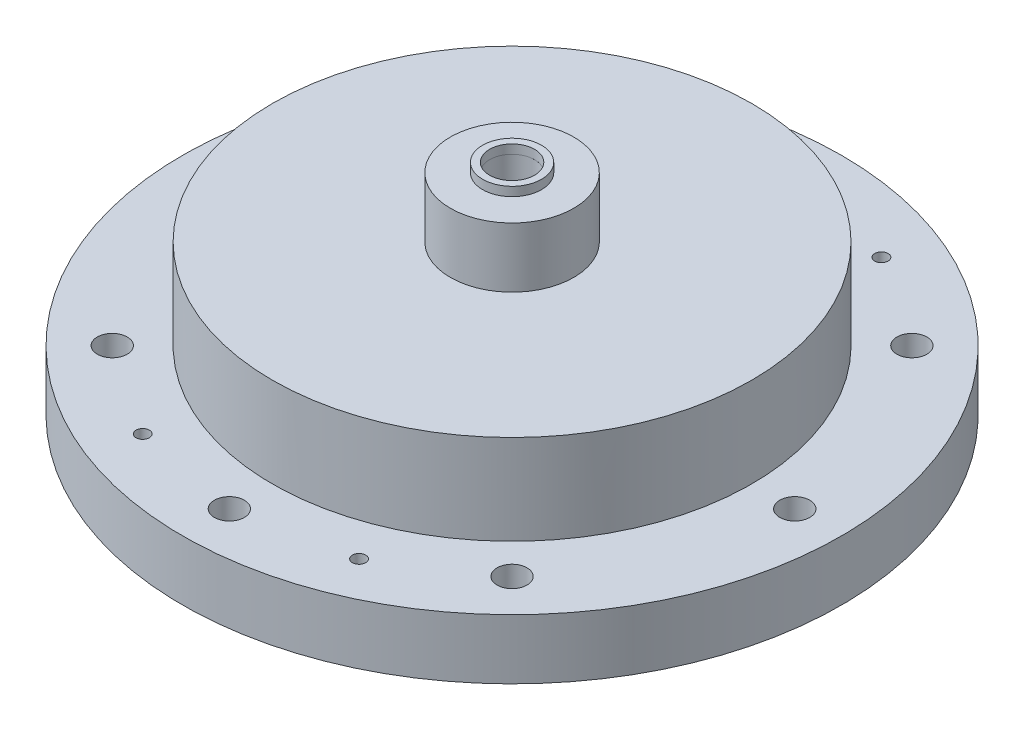
ISO-10303-21;
HEADER;
FILE_DESCRIPTION(('STEP AP214'),'2;1');
FILE_NAME('part.step','',(''),(''),'','','');
FILE_SCHEMA(('AUTOMOTIVE_DESIGN { 1 0 10303 214 1 1 1 1 }'));
ENDSEC;
DATA;
#1=APPLICATION_CONTEXT('core data for automotive mechanical design processes');
#2=APPLICATION_PROTOCOL_DEFINITION('international standard','automotive_design',2000,#1);
#3=PRODUCT_CONTEXT('',#1,'mechanical');
#4=PRODUCT('Part','Part','',(#3));
#5=PRODUCT_RELATED_PRODUCT_CATEGORY('part','',(#4));
#6=PRODUCT_DEFINITION_FORMATION('','',#4);
#7=PRODUCT_DEFINITION_CONTEXT('part definition',#1,'design');
#8=PRODUCT_DEFINITION('design','',#6,#7);
#9=PRODUCT_DEFINITION_SHAPE('','',#8);
#10=(LENGTH_UNIT() NAMED_UNIT(*) SI_UNIT(.MILLI.,.METRE.));
#11=(NAMED_UNIT(*) PLANE_ANGLE_UNIT() SI_UNIT($,.RADIAN.));
#12=(NAMED_UNIT(*) SI_UNIT($,.STERADIAN.) SOLID_ANGLE_UNIT());
#13=UNCERTAINTY_MEASURE_WITH_UNIT(LENGTH_MEASURE(1.E-05),#10,'distance_accuracy_value','');
#14=(GEOMETRIC_REPRESENTATION_CONTEXT(3) GLOBAL_UNCERTAINTY_ASSIGNED_CONTEXT((#13)) GLOBAL_UNIT_ASSIGNED_CONTEXT((#10,
#11,#12)) REPRESENTATION_CONTEXT('',''));
#15=CARTESIAN_POINT('',(0.,0.,0.));
#16=DIRECTION('',(0.,0.,1.));
#17=DIRECTION('',(1.,0.,0.));
#18=AXIS2_PLACEMENT_3D('',#15,#16,#17);
#19=CARTESIAN_POINT('',(0.,46.355,0.));
#20=DIRECTION('',(0.,-1.,0.));
#21=DIRECTION('',(0.,0.,-1.));
#22=AXIS2_PLACEMENT_3D('',#19,#20,#21);
#23=CYLINDRICAL_SURFACE('',#22,6.2484);
#24=CARTESIAN_POINT('',(0.,46.355,0.));
#25=DIRECTION('',(0.,1.,0.));
#26=DIRECTION('',(0.,0.,1.));
#27=AXIS2_PLACEMENT_3D('',#24,#25,#26);
#28=CIRCLE('',#27,6.2484);
#29=CARTESIAN_POINT('',(0.,46.355,6.2484));
#30=VERTEX_POINT('',#29);
#31=EDGE_CURVE('E11',#30,#30,#28,.T.);
#32=ORIENTED_EDGE('',*,*,#31,.F.);
#33=EDGE_LOOP('',(#32));
#34=FACE_BOUND('',#33,.T.);
#35=CARTESIAN_POINT('',(0.,44.45,0.));
#36=DIRECTION('',(0.,1.,0.));
#37=DIRECTION('',(0.,0.,1.));
#38=AXIS2_PLACEMENT_3D('',#35,#36,#37);
#39=CIRCLE('',#38,6.2484);
#40=CARTESIAN_POINT('',(0.,44.45,6.2484));
#41=VERTEX_POINT('',#40);
#42=EDGE_CURVE('E49',#41,#41,#39,.T.);
#43=ORIENTED_EDGE('',*,*,#42,.T.);
#44=EDGE_LOOP('',(#43));
#45=FACE_BOUND('',#44,.T.);
#46=ADVANCED_FACE('F42',(#34,#45),#23,.T.);
#47=CARTESIAN_POINT('',(0.,46.355,0.));
#48=DIRECTION('',(0.,1.,0.));
#49=DIRECTION('',(0.,0.,1.));
#50=AXIS2_PLACEMENT_3D('',#47,#48,#49);
#51=PLANE('',#50);
#52=CARTESIAN_POINT('',(0.,46.355,0.));
#53=DIRECTION('',(0.,1.,0.));
#54=DIRECTION('',(0.,0.,1.));
#55=AXIS2_PLACEMENT_3D('',#52,#53,#54);
#56=CIRCLE('',#55,4.7625);
#57=CARTESIAN_POINT('',(0.,46.355,4.7625));
#58=VERTEX_POINT('',#57);
#59=EDGE_CURVE('E55',#58,#58,#56,.T.);
#60=ORIENTED_EDGE('',*,*,#59,.F.);
#61=EDGE_LOOP('',(#60));
#62=FACE_BOUND('',#61,.T.);
#63=ORIENTED_EDGE('',*,*,#31,.T.);
#64=EDGE_LOOP('',(#63));
#65=FACE_BOUND('',#64,.T.);
#66=ADVANCED_FACE('F71',(#62,#65),#51,.T.);
#67=CARTESIAN_POINT('',(0.,44.45,0.));
#68=DIRECTION('',(0.,1.,0.));
#69=DIRECTION('',(0.,0.,1.));
#70=AXIS2_PLACEMENT_3D('',#67,#68,#69);
#71=PLANE('',#70);
#72=CARTESIAN_POINT('',(0.,44.45,0.));
#73=DIRECTION('',(0.,1.,0.));
#74=DIRECTION('',(0.,0.,1.));
#75=AXIS2_PLACEMENT_3D('',#72,#73,#74);
#76=CIRCLE('',#75,4.7625);
#77=CARTESIAN_POINT('',(0.,44.45,4.7625));
#78=VERTEX_POINT('',#77);
#79=EDGE_CURVE('E45',#78,#78,#76,.T.);
#80=ORIENTED_EDGE('',*,*,#79,.T.);
#81=EDGE_LOOP('',(#80));
#82=FACE_BOUND('',#81,.T.);
#83=ORIENTED_EDGE('',*,*,#42,.F.);
#84=EDGE_LOOP('',(#83));
#85=FACE_BOUND('',#84,.T.);
#86=ADVANCED_FACE('F62',(#82,#85),#71,.F.);
#87=CARTESIAN_POINT('',(0.,-4.445,0.));
#88=DIRECTION('',(0.,1.,0.));
#89=DIRECTION('',(0.,0.,1.));
#90=AXIS2_PLACEMENT_3D('',#87,#88,#89);
#91=CYLINDRICAL_SURFACE('',#90,4.7625);
#92=ORIENTED_EDGE('',*,*,#59,.T.);
#93=EDGE_LOOP('',(#92));
#94=FACE_BOUND('',#93,.T.);
#95=ORIENTED_EDGE('',*,*,#79,.F.);
#96=EDGE_LOOP('',(#95));
#97=FACE_BOUND('',#96,.T.);
#98=ADVANCED_FACE('F65',(#94,#97),#91,.F.);
#99=CLOSED_SHELL('',(#46,#66,#86,#98));
#100=MANIFOLD_SOLID_BREP('B2',#99);
#101=CARTESIAN_POINT('',(0.,44.45,0.));
#102=DIRECTION('',(0.,-1.,0.));
#103=DIRECTION('',(0.,0.,-1.));
#104=AXIS2_PLACEMENT_3D('',#101,#102,#103);
#105=CYLINDRICAL_SURFACE('',#104,4.7625);
#106=CARTESIAN_POINT('',(0.,44.45,0.));
#107=DIRECTION('',(0.,1.,0.));
#108=DIRECTION('',(0.,0.,1.));
#109=AXIS2_PLACEMENT_3D('',#106,#107,#108);
#110=CIRCLE('',#109,4.7625);
#111=CARTESIAN_POINT('',(0.,44.45,4.7625));
#112=VERTEX_POINT('',#111);
#113=EDGE_CURVE('E168',#112,#112,#110,.T.);
#114=ORIENTED_EDGE('',*,*,#113,.T.);
#115=EDGE_LOOP('',(#114));
#116=FACE_BOUND('',#115,.T.);
#117=CARTESIAN_POINT('',(0.,25.4,0.));
#118=DIRECTION('',(0.,-1.,0.));
#119=DIRECTION('',(0.,0.,-1.));
#120=AXIS2_PLACEMENT_3D('',#117,#118,#119);
#121=CIRCLE('',#120,4.7625);
#122=CARTESIAN_POINT('',(0.,25.4,-4.7625));
#123=VERTEX_POINT('',#122);
#124=EDGE_CURVE('E108',#123,#123,#121,.T.);
#125=ORIENTED_EDGE('',*,*,#124,.T.);
#126=EDGE_LOOP('',(#125));
#127=FACE_BOUND('',#126,.T.);
#128=ADVANCED_FACE('F104',(#116,#127),#105,.F.);
#129=CARTESIAN_POINT('',(0.,25.4,0.));
#130=DIRECTION('',(0.,-1.,0.));
#131=DIRECTION('',(0.,0.,-1.));
#132=AXIS2_PLACEMENT_3D('',#129,#130,#131);
#133=CYLINDRICAL_SURFACE('',#132,50.8);
#134=CARTESIAN_POINT('',(0.,12.7,0.));
#135=DIRECTION('',(0.,-1.,0.));
#136=DIRECTION('',(0.,0.,-1.));
#137=AXIS2_PLACEMENT_3D('',#134,#135,#136);
#138=CIRCLE('',#137,50.8);
#139=CARTESIAN_POINT('',(0.,12.7,-50.8));
#140=VERTEX_POINT('',#139);
#141=EDGE_CURVE('E41',#140,#140,#138,.T.);
#142=ORIENTED_EDGE('',*,*,#141,.F.);
#143=EDGE_LOOP('',(#142));
#144=FACE_BOUND('',#143,.T.);
#145=CARTESIAN_POINT('',(0.,31.75,0.));
#146=DIRECTION('',(0.,1.,0.));
#147=DIRECTION('',(0.,0.,1.));
#148=AXIS2_PLACEMENT_3D('',#145,#146,#147);
#149=CIRCLE('',#148,50.8);
#150=CARTESIAN_POINT('',(0.,31.75,50.8));
#151=VERTEX_POINT('',#150);
#152=EDGE_CURVE('E160',#151,#151,#149,.T.);
#153=ORIENTED_EDGE('',*,*,#152,.F.);
#154=EDGE_LOOP('',(#153));
#155=FACE_BOUND('',#154,.T.);
#156=ADVANCED_FACE('F106',(#144,#155),#133,.T.);
#157=CARTESIAN_POINT('',(0.,12.7,0.));
#158=DIRECTION('',(0.,-1.,0.));
#159=DIRECTION('',(0.,0.,-1.));
#160=AXIS2_PLACEMENT_3D('',#157,#158,#159);
#161=CYLINDRICAL_SURFACE('',#160,69.85);
#162=CARTESIAN_POINT('',(0.,12.7,0.));
#163=DIRECTION('',(0.,-1.,0.));
#164=DIRECTION('',(0.,0.,-1.));
#165=AXIS2_PLACEMENT_3D('',#162,#163,#164);
#166=CIRCLE('',#165,69.85);
#167=CARTESIAN_POINT('',(0.,12.7,-69.85));
#168=VERTEX_POINT('',#167);
#169=EDGE_CURVE('E112',#168,#168,#166,.T.);
#170=ORIENTED_EDGE('',*,*,#169,.T.);
#171=EDGE_LOOP('',(#170));
#172=FACE_BOUND('',#171,.T.);
#173=CARTESIAN_POINT('',(0.,0.,0.));
#174=DIRECTION('',(0.,-1.,0.));
#175=DIRECTION('',(0.,0.,-1.));
#176=AXIS2_PLACEMENT_3D('',#173,#174,#175);
#177=CIRCLE('',#176,69.85);
#178=CARTESIAN_POINT('',(0.,0.,-69.85));
#179=VERTEX_POINT('',#178);
#180=EDGE_CURVE('E117',#179,#179,#177,.T.);
#181=ORIENTED_EDGE('',*,*,#180,.F.);
#182=EDGE_LOOP('',(#181));
#183=FACE_BOUND('',#182,.T.);
#184=ADVANCED_FACE('F228',(#172,#183),#161,.T.);
#185=CARTESIAN_POINT('',(0.,12.7,0.));
#186=DIRECTION('',(0.,-1.,0.));
#187=DIRECTION('',(0.,0.,-1.));
#188=AXIS2_PLACEMENT_3D('',#185,#186,#187);
#189=PLANE('',#188);
#190=CARTESIAN_POINT('',(22.9298555105109,12.7,55.3575681567308));
#191=DIRECTION('',(0.,-1.,0.));
#192=DIRECTION('',(0.,0.,-1.));
#193=AXIS2_PLACEMENT_3D('',#190,#191,#192);
#194=CIRCLE('',#193,1.4097);
#195=CARTESIAN_POINT('',(22.9298555105109,12.7,53.9478681567308));
#196=VERTEX_POINT('',#195);
#197=EDGE_CURVE('E130',#196,#196,#194,.T.);
#198=ORIENTED_EDGE('',*,*,#197,.T.);
#199=EDGE_LOOP('',(#198));
#200=FACE_BOUND('',#199,.T.);
#201=CARTESIAN_POINT('',(-22.9298555105109,12.7,-55.3575681567308));
#202=DIRECTION('',(0.,-1.,0.));
#203=DIRECTION('',(0.,0.,-1.));
#204=AXIS2_PLACEMENT_3D('',#201,#202,#203);
#205=CIRCLE('',#204,1.4097);
#206=CARTESIAN_POINT('',(-22.9298555105109,12.7,-56.7672681567308));
#207=VERTEX_POINT('',#206);
#208=EDGE_CURVE('E128',#207,#207,#205,.T.);
#209=ORIENTED_EDGE('',*,*,#208,.T.);
#210=EDGE_LOOP('',(#209));
#211=FACE_BOUND('',#210,.T.);
#212=CARTESIAN_POINT('',(22.9298555105109,12.7,-55.3575681567308));
#213=DIRECTION('',(0.,-1.,0.));
#214=DIRECTION('',(0.,0.,-1.));
#215=AXIS2_PLACEMENT_3D('',#212,#213,#214);
#216=CIRCLE('',#215,1.4097);
#217=CARTESIAN_POINT('',(22.9298555105109,12.7,-56.7672681567308));
#218=VERTEX_POINT('',#217);
#219=EDGE_CURVE('E124',#218,#218,#216,.T.);
#220=ORIENTED_EDGE('',*,*,#219,.T.);
#221=EDGE_LOOP('',(#220));
#222=FACE_BOUND('',#221,.T.);
#223=CARTESIAN_POINT('',(-22.9298555105109,12.7,55.3575681567308));
#224=DIRECTION('',(0.,-1.,0.));
#225=DIRECTION('',(0.,0.,-1.));
#226=AXIS2_PLACEMENT_3D('',#223,#224,#225);
#227=CIRCLE('',#226,1.4097);
#228=CARTESIAN_POINT('',(-22.9298555105109,12.7,53.9478681567308));
#229=VERTEX_POINT('',#228);
#230=EDGE_CURVE('E121',#229,#229,#227,.T.);
#231=ORIENTED_EDGE('',*,*,#230,.T.);
#232=EDGE_LOOP('',(#231));
#233=FACE_BOUND('',#232,.T.);
#234=CARTESIAN_POINT('',(0.,12.7,-59.9186));
#235=DIRECTION('',(0.,-1.,0.));
#236=DIRECTION('',(0.,0.,-1.));
#237=AXIS2_PLACEMENT_3D('',#234,#235,#236);
#238=CIRCLE('',#237,3.175);
#239=CARTESIAN_POINT('',(0.,12.7,-63.0936));
#240=VERTEX_POINT('',#239);
#241=EDGE_CURVE('E178',#240,#240,#238,.F.);
#242=ORIENTED_EDGE('',*,*,#241,.F.);
#243=EDGE_LOOP('',(#242));
#244=FACE_BOUND('',#243,.T.);
#245=CARTESIAN_POINT('',(-42.3688483792043,12.7,-42.3688483792043));
#246=DIRECTION('',(0.,-1.,0.));
#247=DIRECTION('',(0.,0.,-1.));
#248=AXIS2_PLACEMENT_3D('',#245,#246,#247);
#249=CIRCLE('',#248,3.17500000000001);
#250=CARTESIAN_POINT('',(-42.3688483792043,12.7,-45.5438483792043));
#251=VERTEX_POINT('',#250);
#252=EDGE_CURVE('E179',#251,#251,#249,.F.);
#253=ORIENTED_EDGE('',*,*,#252,.F.);
#254=EDGE_LOOP('',(#253));
#255=FACE_BOUND('',#254,.T.);
#256=CARTESIAN_POINT('',(-59.9186,12.7,0.));
#257=DIRECTION('',(0.,-1.,0.));
#258=DIRECTION('',(0.,0.,-1.));
#259=AXIS2_PLACEMENT_3D('',#256,#257,#258);
#260=CIRCLE('',#259,3.17499999999999);
#261=CARTESIAN_POINT('',(-59.9186,12.7,-3.17499999999999));
#262=VERTEX_POINT('',#261);
#263=EDGE_CURVE('E185',#262,#262,#260,.F.);
#264=ORIENTED_EDGE('',*,*,#263,.F.);
#265=EDGE_LOOP('',(#264));
#266=FACE_BOUND('',#265,.T.);
#267=CARTESIAN_POINT('',(-42.3688483792043,12.7,42.3688483792043));
#268=DIRECTION('',(0.,-1.,0.));
#269=DIRECTION('',(0.,0.,-1.));
#270=AXIS2_PLACEMENT_3D('',#267,#268,#269);
#271=CIRCLE('',#270,3.17499999999999);
#272=CARTESIAN_POINT('',(-42.3688483792043,12.7,39.1938483792043));
#273=VERTEX_POINT('',#272);
#274=EDGE_CURVE('E191',#273,#273,#271,.F.);
#275=ORIENTED_EDGE('',*,*,#274,.F.);
#276=EDGE_LOOP('',(#275));
#277=FACE_BOUND('',#276,.T.);
#278=CARTESIAN_POINT('',(0.,12.7,59.9186));
#279=DIRECTION('',(0.,-1.,0.));
#280=DIRECTION('',(0.,0.,-1.));
#281=AXIS2_PLACEMENT_3D('',#278,#279,#280);
#282=CIRCLE('',#281,3.17499999999999);
#283=CARTESIAN_POINT('',(0.,12.7,56.7436));
#284=VERTEX_POINT('',#283);
#285=EDGE_CURVE('E197',#284,#284,#282,.F.);
#286=ORIENTED_EDGE('',*,*,#285,.F.);
#287=EDGE_LOOP('',(#286));
#288=FACE_BOUND('',#287,.T.);
#289=CARTESIAN_POINT('',(42.3688483792043,12.7,42.3688483792043));
#290=DIRECTION('',(0.,-1.,0.));
#291=DIRECTION('',(0.,0.,-1.));
#292=AXIS2_PLACEMENT_3D('',#289,#290,#291);
#293=CIRCLE('',#292,3.17500000000001);
#294=CARTESIAN_POINT('',(42.3688483792043,12.7,39.1938483792043));
#295=VERTEX_POINT('',#294);
#296=EDGE_CURVE('E203',#295,#295,#293,.F.);
#297=ORIENTED_EDGE('',*,*,#296,.F.);
#298=EDGE_LOOP('',(#297));
#299=FACE_BOUND('',#298,.T.);
#300=CARTESIAN_POINT('',(59.9186,12.7,0.));
#301=DIRECTION('',(0.,-1.,0.));
#302=DIRECTION('',(0.,0.,-1.));
#303=AXIS2_PLACEMENT_3D('',#300,#301,#302);
#304=CIRCLE('',#303,3.175);
#305=CARTESIAN_POINT('',(59.9186,12.7,-3.17499999999999));
#306=VERTEX_POINT('',#305);
#307=EDGE_CURVE('E209',#306,#306,#304,.F.);
#308=ORIENTED_EDGE('',*,*,#307,.F.);
#309=EDGE_LOOP('',(#308));
#310=FACE_BOUND('',#309,.T.);
#311=CARTESIAN_POINT('',(42.3688483792043,12.7,-42.3688483792043));
#312=DIRECTION('',(0.,-1.,0.));
#313=DIRECTION('',(0.,0.,-1.));
#314=AXIS2_PLACEMENT_3D('',#311,#312,#313);
#315=CIRCLE('',#314,3.175);
#316=CARTESIAN_POINT('',(42.3688483792043,12.7,-45.5438483792042));
#317=VERTEX_POINT('',#316);
#318=EDGE_CURVE('E215',#317,#317,#315,.F.);
#319=ORIENTED_EDGE('',*,*,#318,.F.);
#320=EDGE_LOOP('',(#319));
#321=FACE_BOUND('',#320,.T.);
#322=ORIENTED_EDGE('',*,*,#141,.T.);
#323=EDGE_LOOP('',(#322));
#324=FACE_BOUND('',#323,.T.);
#325=ORIENTED_EDGE('',*,*,#169,.F.);
#326=EDGE_LOOP('',(#325));
#327=FACE_BOUND('',#326,.T.);
#328=ADVANCED_FACE('F225',(#200,#211,#222,#233,#244,#255,#266,#277,#288,#299,#310,#321,#324,
#327),#189,.F.);
#329=CARTESIAN_POINT('',(0.,0.,0.));
#330=DIRECTION('',(0.,1.,0.));
#331=DIRECTION('',(0.,0.,1.));
#332=AXIS2_PLACEMENT_3D('',#329,#330,#331);
#333=PLANE('',#332);
#334=CARTESIAN_POINT('',(0.,0.,0.));
#335=DIRECTION('',(0.,-1.,0.));
#336=DIRECTION('',(0.,0.,-1.));
#337=AXIS2_PLACEMENT_3D('',#334,#335,#336);
#338=CIRCLE('',#337,44.45);
#339=CARTESIAN_POINT('',(0.,0.,-44.45));
#340=VERTEX_POINT('',#339);
#341=EDGE_CURVE('E481',#340,#340,#338,.T.);
#342=ORIENTED_EDGE('',*,*,#341,.F.);
#343=EDGE_LOOP('',(#342));
#344=FACE_BOUND('',#343,.T.);
#345=CARTESIAN_POINT('',(22.9298555105109,0.,55.3575681567308));
#346=DIRECTION('',(0.,-1.,0.));
#347=DIRECTION('',(0.,0.,-1.));
#348=AXIS2_PLACEMENT_3D('',#345,#346,#347);
#349=CIRCLE('',#348,3.175);
#350=CARTESIAN_POINT('',(22.9298555105109,0.,52.1825681567308));
#351=VERTEX_POINT('',#350);
#352=EDGE_CURVE('E149',#351,#351,#349,.T.);
#353=ORIENTED_EDGE('',*,*,#352,.F.);
#354=EDGE_LOOP('',(#353));
#355=FACE_BOUND('',#354,.T.);
#356=CARTESIAN_POINT('',(-22.9298555105109,0.,-55.3575681567308));
#357=DIRECTION('',(0.,-1.,0.));
#358=DIRECTION('',(0.,0.,-1.));
#359=AXIS2_PLACEMENT_3D('',#356,#357,#358);
#360=CIRCLE('',#359,3.175);
#361=CARTESIAN_POINT('',(-22.9298555105109,0.,-58.5325681567308));
#362=VERTEX_POINT('',#361);
#363=EDGE_CURVE('E141',#362,#362,#360,.T.);
#364=ORIENTED_EDGE('',*,*,#363,.F.);
#365=EDGE_LOOP('',(#364));
#366=FACE_BOUND('',#365,.T.);
#367=CARTESIAN_POINT('',(22.9298555105109,0.,-55.3575681567308));
#368=DIRECTION('',(0.,-1.,0.));
#369=DIRECTION('',(0.,0.,-1.));
#370=AXIS2_PLACEMENT_3D('',#367,#368,#369);
#371=CIRCLE('',#370,3.175);
#372=CARTESIAN_POINT('',(22.9298555105109,0.,-58.5325681567308));
#373=VERTEX_POINT('',#372);
#374=EDGE_CURVE('E132',#373,#373,#371,.T.);
#375=ORIENTED_EDGE('',*,*,#374,.F.);
#376=EDGE_LOOP('',(#375));
#377=FACE_BOUND('',#376,.T.);
#378=CARTESIAN_POINT('',(-22.9298555105109,0.,55.3575681567308));
#379=DIRECTION('',(0.,-1.,0.));
#380=DIRECTION('',(0.,0.,-1.));
#381=AXIS2_PLACEMENT_3D('',#378,#379,#380);
#382=CIRCLE('',#381,3.175);
#383=CARTESIAN_POINT('',(-22.9298555105109,0.,52.1825681567308));
#384=VERTEX_POINT('',#383);
#385=EDGE_CURVE('E148',#384,#384,#382,.T.);
#386=ORIENTED_EDGE('',*,*,#385,.F.);
#387=EDGE_LOOP('',(#386));
#388=FACE_BOUND('',#387,.T.);
#389=CARTESIAN_POINT('',(0.,0.,-59.9186));
#390=DIRECTION('',(0.,-1.,0.));
#391=DIRECTION('',(0.,0.,-1.));
#392=AXIS2_PLACEMENT_3D('',#389,#390,#391);
#393=CIRCLE('',#392,3.175);
#394=CARTESIAN_POINT('',(0.,0.,-63.0936));
#395=VERTEX_POINT('',#394);
#396=EDGE_CURVE('E175',#395,#395,#393,.T.);
#397=ORIENTED_EDGE('',*,*,#396,.F.);
#398=EDGE_LOOP('',(#397));
#399=FACE_BOUND('',#398,.T.);
#400=CARTESIAN_POINT('',(-42.3688483792043,0.,-42.3688483792043));
#401=DIRECTION('',(0.,-1.,0.));
#402=DIRECTION('',(0.,0.,-1.));
#403=AXIS2_PLACEMENT_3D('',#400,#401,#402);
#404=CIRCLE('',#403,3.17500000000001);
#405=CARTESIAN_POINT('',(-42.3688483792043,0.,-45.5438483792043));
#406=VERTEX_POINT('',#405);
#407=EDGE_CURVE('E182',#406,#406,#404,.T.);
#408=ORIENTED_EDGE('',*,*,#407,.F.);
#409=EDGE_LOOP('',(#408));
#410=FACE_BOUND('',#409,.T.);
#411=CARTESIAN_POINT('',(-59.9186,0.,0.));
#412=DIRECTION('',(0.,-1.,0.));
#413=DIRECTION('',(0.,0.,-1.));
#414=AXIS2_PLACEMENT_3D('',#411,#412,#413);
#415=CIRCLE('',#414,3.17499999999999);
#416=CARTESIAN_POINT('',(-59.9186,0.,-3.17499999999999));
#417=VERTEX_POINT('',#416);
#418=EDGE_CURVE('E188',#417,#417,#415,.T.);
#419=ORIENTED_EDGE('',*,*,#418,.F.);
#420=EDGE_LOOP('',(#419));
#421=FACE_BOUND('',#420,.T.);
#422=CARTESIAN_POINT('',(-42.3688483792043,0.,42.3688483792043));
#423=DIRECTION('',(0.,-1.,0.));
#424=DIRECTION('',(0.,0.,-1.));
#425=AXIS2_PLACEMENT_3D('',#422,#423,#424);
#426=CIRCLE('',#425,3.17499999999999);
#427=CARTESIAN_POINT('',(-42.3688483792043,0.,39.1938483792043));
#428=VERTEX_POINT('',#427);
#429=EDGE_CURVE('E194',#428,#428,#426,.T.);
#430=ORIENTED_EDGE('',*,*,#429,.F.);
#431=EDGE_LOOP('',(#430));
#432=FACE_BOUND('',#431,.T.);
#433=CARTESIAN_POINT('',(0.,0.,59.9186));
#434=DIRECTION('',(0.,-1.,0.));
#435=DIRECTION('',(0.,0.,-1.));
#436=AXIS2_PLACEMENT_3D('',#433,#434,#435);
#437=CIRCLE('',#436,3.17499999999999);
#438=CARTESIAN_POINT('',(0.,0.,56.7436));
#439=VERTEX_POINT('',#438);
#440=EDGE_CURVE('E200',#439,#439,#437,.T.);
#441=ORIENTED_EDGE('',*,*,#440,.F.);
#442=EDGE_LOOP('',(#441));
#443=FACE_BOUND('',#442,.T.);
#444=CARTESIAN_POINT('',(42.3688483792043,0.,42.3688483792043));
#445=DIRECTION('',(0.,-1.,0.));
#446=DIRECTION('',(0.,0.,-1.));
#447=AXIS2_PLACEMENT_3D('',#444,#445,#446);
#448=CIRCLE('',#447,3.17500000000001);
#449=CARTESIAN_POINT('',(42.3688483792043,0.,39.1938483792043));
#450=VERTEX_POINT('',#449);
#451=EDGE_CURVE('E206',#450,#450,#448,.T.);
#452=ORIENTED_EDGE('',*,*,#451,.F.);
#453=EDGE_LOOP('',(#452));
#454=FACE_BOUND('',#453,.T.);
#455=CARTESIAN_POINT('',(59.9186,0.,0.));
#456=DIRECTION('',(0.,-1.,0.));
#457=DIRECTION('',(0.,0.,-1.));
#458=AXIS2_PLACEMENT_3D('',#455,#456,#457);
#459=CIRCLE('',#458,3.175);
#460=CARTESIAN_POINT('',(59.9186,0.,-3.17499999999999));
#461=VERTEX_POINT('',#460);
#462=EDGE_CURVE('E212',#461,#461,#459,.T.);
#463=ORIENTED_EDGE('',*,*,#462,.F.);
#464=EDGE_LOOP('',(#463));
#465=FACE_BOUND('',#464,.T.);
#466=CARTESIAN_POINT('',(42.3688483792043,0.,-42.3688483792043));
#467=DIRECTION('',(0.,-1.,0.));
#468=DIRECTION('',(0.,0.,-1.));
#469=AXIS2_PLACEMENT_3D('',#466,#467,#468);
#470=CIRCLE('',#469,3.175);
#471=CARTESIAN_POINT('',(42.3688483792043,0.,-45.5438483792042));
#472=VERTEX_POINT('',#471);
#473=EDGE_CURVE('E174',#472,#472,#470,.T.);
#474=ORIENTED_EDGE('',*,*,#473,.F.);
#475=EDGE_LOOP('',(#474));
#476=FACE_BOUND('',#475,.T.);
#477=ORIENTED_EDGE('',*,*,#180,.T.);
#478=EDGE_LOOP('',(#477));
#479=FACE_BOUND('',#478,.T.);
#480=ADVANCED_FACE('F227',(#344,#355,#366,#377,#388,#399,#410,#421,#432,#443,#454,#465,#476,
#479),#333,.F.);
#481=CARTESIAN_POINT('',(42.3688483792043,25.401,-42.3688483792043));
#482=DIRECTION('',(0.,-1.,0.));
#483=DIRECTION('',(0.,0.,-1.));
#484=AXIS2_PLACEMENT_3D('',#481,#482,#483);
#485=CYLINDRICAL_SURFACE('',#484,3.175);
#486=ORIENTED_EDGE('',*,*,#473,.T.);
#487=EDGE_LOOP('',(#486));
#488=FACE_BOUND('',#487,.T.);
#489=ORIENTED_EDGE('',*,*,#318,.T.);
#490=EDGE_LOOP('',(#489));
#491=FACE_BOUND('',#490,.T.);
#492=ADVANCED_FACE('F223',(#488,#491),#485,.F.);
#493=CARTESIAN_POINT('',(59.9186,25.401,0.));
#494=DIRECTION('',(0.,-1.,0.));
#495=DIRECTION('',(0.,0.,-1.));
#496=AXIS2_PLACEMENT_3D('',#493,#494,#495);
#497=CYLINDRICAL_SURFACE('',#496,3.175);
#498=ORIENTED_EDGE('',*,*,#462,.T.);
#499=EDGE_LOOP('',(#498));
#500=FACE_BOUND('',#499,.T.);
#501=ORIENTED_EDGE('',*,*,#307,.T.);
#502=EDGE_LOOP('',(#501));
#503=FACE_BOUND('',#502,.T.);
#504=ADVANCED_FACE('F246',(#500,#503),#497,.F.);
#505=CARTESIAN_POINT('',(42.3688483792043,25.401,42.3688483792043));
#506=DIRECTION('',(0.,-1.,0.));
#507=DIRECTION('',(0.,0.,-1.));
#508=AXIS2_PLACEMENT_3D('',#505,#506,#507);
#509=CYLINDRICAL_SURFACE('',#508,3.17500000000001);
#510=ORIENTED_EDGE('',*,*,#451,.T.);
#511=EDGE_LOOP('',(#510));
#512=FACE_BOUND('',#511,.T.);
#513=ORIENTED_EDGE('',*,*,#296,.T.);
#514=EDGE_LOOP('',(#513));
#515=FACE_BOUND('',#514,.T.);
#516=ADVANCED_FACE('F291',(#512,#515),#509,.F.);
#517=CARTESIAN_POINT('',(0.,25.401,59.9186));
#518=DIRECTION('',(0.,-1.,0.));
#519=DIRECTION('',(0.,0.,-1.));
#520=AXIS2_PLACEMENT_3D('',#517,#518,#519);
#521=CYLINDRICAL_SURFACE('',#520,3.17499999999999);
#522=ORIENTED_EDGE('',*,*,#440,.T.);
#523=EDGE_LOOP('',(#522));
#524=FACE_BOUND('',#523,.T.);
#525=ORIENTED_EDGE('',*,*,#285,.T.);
#526=EDGE_LOOP('',(#525));
#527=FACE_BOUND('',#526,.T.);
#528=ADVANCED_FACE('F287',(#524,#527),#521,.F.);
#529=CARTESIAN_POINT('',(-42.3688483792043,25.401,42.3688483792043));
#530=DIRECTION('',(0.,-1.,0.));
#531=DIRECTION('',(0.,0.,-1.));
#532=AXIS2_PLACEMENT_3D('',#529,#530,#531);
#533=CYLINDRICAL_SURFACE('',#532,3.17499999999999);
#534=ORIENTED_EDGE('',*,*,#429,.T.);
#535=EDGE_LOOP('',(#534));
#536=FACE_BOUND('',#535,.T.);
#537=ORIENTED_EDGE('',*,*,#274,.T.);
#538=EDGE_LOOP('',(#537));
#539=FACE_BOUND('',#538,.T.);
#540=ADVANCED_FACE('F283',(#536,#539),#533,.F.);
#541=CARTESIAN_POINT('',(-59.9186,25.401,0.));
#542=DIRECTION('',(0.,-1.,0.));
#543=DIRECTION('',(0.,0.,-1.));
#544=AXIS2_PLACEMENT_3D('',#541,#542,#543);
#545=CYLINDRICAL_SURFACE('',#544,3.17499999999999);
#546=ORIENTED_EDGE('',*,*,#418,.T.);
#547=EDGE_LOOP('',(#546));
#548=FACE_BOUND('',#547,.T.);
#549=ORIENTED_EDGE('',*,*,#263,.T.);
#550=EDGE_LOOP('',(#549));
#551=FACE_BOUND('',#550,.T.);
#552=ADVANCED_FACE('F279',(#548,#551),#545,.F.);
#553=CARTESIAN_POINT('',(-42.3688483792043,25.401,-42.3688483792043));
#554=DIRECTION('',(0.,-1.,0.));
#555=DIRECTION('',(0.,0.,-1.));
#556=AXIS2_PLACEMENT_3D('',#553,#554,#555);
#557=CYLINDRICAL_SURFACE('',#556,3.17500000000001);
#558=ORIENTED_EDGE('',*,*,#407,.T.);
#559=EDGE_LOOP('',(#558));
#560=FACE_BOUND('',#559,.T.);
#561=ORIENTED_EDGE('',*,*,#252,.T.);
#562=EDGE_LOOP('',(#561));
#563=FACE_BOUND('',#562,.T.);
#564=ADVANCED_FACE('F275',(#560,#563),#557,.F.);
#565=CARTESIAN_POINT('',(0.,25.401,-59.9186));
#566=DIRECTION('',(0.,-1.,0.));
#567=DIRECTION('',(0.,0.,-1.));
#568=AXIS2_PLACEMENT_3D('',#565,#566,#567);
#569=CYLINDRICAL_SURFACE('',#568,3.175);
#570=ORIENTED_EDGE('',*,*,#396,.T.);
#571=EDGE_LOOP('',(#570));
#572=FACE_BOUND('',#571,.T.);
#573=ORIENTED_EDGE('',*,*,#241,.T.);
#574=EDGE_LOOP('',(#573));
#575=FACE_BOUND('',#574,.T.);
#576=ADVANCED_FACE('F272',(#572,#575),#569,.F.);
#577=CARTESIAN_POINT('',(0.,31.75,0.));
#578=DIRECTION('',(0.,1.,0.));
#579=DIRECTION('',(0.,0.,1.));
#580=AXIS2_PLACEMENT_3D('',#577,#578,#579);
#581=PLANE('',#580);
#582=CARTESIAN_POINT('',(0.,31.75,0.));
#583=DIRECTION('',(0.,1.,0.));
#584=DIRECTION('',(0.,0.,1.));
#585=AXIS2_PLACEMENT_3D('',#582,#583,#584);
#586=CIRCLE('',#585,13.081);
#587=CARTESIAN_POINT('',(0.,31.75,13.081));
#588=VERTEX_POINT('',#587);
#589=EDGE_CURVE('E165',#588,#588,#586,.T.);
#590=ORIENTED_EDGE('',*,*,#589,.F.);
#591=EDGE_LOOP('',(#590));
#592=FACE_BOUND('',#591,.T.);
#593=ORIENTED_EDGE('',*,*,#152,.T.);
#594=EDGE_LOOP('',(#593));
#595=FACE_BOUND('',#594,.T.);
#596=ADVANCED_FACE('F261',(#592,#595),#581,.T.);
#597=CARTESIAN_POINT('',(0.,44.45,0.));
#598=DIRECTION('',(0.,-1.,0.));
#599=DIRECTION('',(0.,0.,-1.));
#600=AXIS2_PLACEMENT_3D('',#597,#598,#599);
#601=CYLINDRICAL_SURFACE('',#600,13.081);
#602=ORIENTED_EDGE('',*,*,#589,.T.);
#603=EDGE_LOOP('',(#602));
#604=FACE_BOUND('',#603,.T.);
#605=CARTESIAN_POINT('',(0.,44.45,0.));
#606=DIRECTION('',(0.,1.,0.));
#607=DIRECTION('',(0.,0.,1.));
#608=AXIS2_PLACEMENT_3D('',#605,#606,#607);
#609=CIRCLE('',#608,13.081);
#610=CARTESIAN_POINT('',(0.,44.45,13.081));
#611=VERTEX_POINT('',#610);
#612=EDGE_CURVE('E171',#611,#611,#609,.T.);
#613=ORIENTED_EDGE('',*,*,#612,.F.);
#614=EDGE_LOOP('',(#613));
#615=FACE_BOUND('',#614,.T.);
#616=ADVANCED_FACE('F267',(#604,#615),#601,.T.);
#617=CARTESIAN_POINT('',(0.,44.45,0.));
#618=DIRECTION('',(0.,1.,0.));
#619=DIRECTION('',(0.,0.,1.));
#620=AXIS2_PLACEMENT_3D('',#617,#618,#619);
#621=PLANE('',#620);
#622=ORIENTED_EDGE('',*,*,#612,.T.);
#623=EDGE_LOOP('',(#622));
#624=FACE_BOUND('',#623,.T.);
#625=ORIENTED_EDGE('',*,*,#113,.F.);
#626=EDGE_LOOP('',(#625));
#627=FACE_BOUND('',#626,.T.);
#628=ADVANCED_FACE('F263',(#624,#627),#621,.T.);
#629=CARTESIAN_POINT('',(-22.9298555105109,6.35,55.3575681567308));
#630=DIRECTION('',(0.,-1.,0.));
#631=DIRECTION('',(0.,0.,-1.));
#632=AXIS2_PLACEMENT_3D('',#629,#630,#631);
#633=CYLINDRICAL_SURFACE('',#632,3.175);
#634=CARTESIAN_POINT('',(-22.9298555105109,6.35,55.3575681567308));
#635=DIRECTION('',(0.,-1.,0.));
#636=DIRECTION('',(0.,0.,-1.));
#637=AXIS2_PLACEMENT_3D('',#634,#635,#636);
#638=CIRCLE('',#637,3.175);
#639=CARTESIAN_POINT('',(-22.9298555105109,6.35,52.1825681567308));
#640=VERTEX_POINT('',#639);
#641=EDGE_CURVE('E157',#640,#640,#638,.T.);
#642=ORIENTED_EDGE('',*,*,#641,.F.);
#643=EDGE_LOOP('',(#642));
#644=FACE_BOUND('',#643,.T.);
#645=ORIENTED_EDGE('',*,*,#385,.T.);
#646=EDGE_LOOP('',(#645));
#647=FACE_BOUND('',#646,.T.);
#648=ADVANCED_FACE('F266',(#644,#647),#633,.F.);
#649=CARTESIAN_POINT('',(-22.9298555105109,6.35,55.3575681567308));
#650=DIRECTION('',(0.,-1.,0.));
#651=DIRECTION('',(0.,0.,-1.));
#652=AXIS2_PLACEMENT_3D('',#649,#650,#651);
#653=PLANE('',#652);
#654=CARTESIAN_POINT('',(-22.9298555105109,6.35,55.3575681567308));
#655=DIRECTION('',(0.,-1.,0.));
#656=DIRECTION('',(0.,0.,-1.));
#657=AXIS2_PLACEMENT_3D('',#654,#655,#656);
#658=CIRCLE('',#657,1.4097);
#659=CARTESIAN_POINT('',(-22.9298555105109,6.35,53.9478681567308));
#660=VERTEX_POINT('',#659);
#661=EDGE_CURVE('E125',#660,#660,#658,.T.);
#662=ORIENTED_EDGE('',*,*,#661,.F.);
#663=EDGE_LOOP('',(#662));
#664=FACE_BOUND('',#663,.T.);
#665=ORIENTED_EDGE('',*,*,#641,.T.);
#666=EDGE_LOOP('',(#665));
#667=FACE_BOUND('',#666,.T.);
#668=ADVANCED_FACE('F355',(#664,#667),#653,.T.);
#669=CARTESIAN_POINT('',(22.9298555105109,6.35,-55.3575681567308));
#670=DIRECTION('',(0.,-1.,0.));
#671=DIRECTION('',(0.,0.,-1.));
#672=AXIS2_PLACEMENT_3D('',#669,#670,#671);
#673=CYLINDRICAL_SURFACE('',#672,3.175);
#674=CARTESIAN_POINT('',(22.9298555105109,6.35,-55.3575681567308));
#675=DIRECTION('',(0.,-1.,0.));
#676=DIRECTION('',(0.,0.,-1.));
#677=AXIS2_PLACEMENT_3D('',#674,#675,#676);
#678=CIRCLE('',#677,3.175);
#679=CARTESIAN_POINT('',(22.9298555105109,6.35,-58.5325681567308));
#680=VERTEX_POINT('',#679);
#681=EDGE_CURVE('E136',#680,#680,#678,.T.);
#682=ORIENTED_EDGE('',*,*,#681,.F.);
#683=EDGE_LOOP('',(#682));
#684=FACE_BOUND('',#683,.T.);
#685=ORIENTED_EDGE('',*,*,#374,.T.);
#686=EDGE_LOOP('',(#685));
#687=FACE_BOUND('',#686,.T.);
#688=ADVANCED_FACE('F363',(#684,#687),#673,.F.);
#689=CARTESIAN_POINT('',(22.9298555105109,6.35,-55.3575681567308));
#690=DIRECTION('',(0.,-1.,0.));
#691=DIRECTION('',(0.,0.,-1.));
#692=AXIS2_PLACEMENT_3D('',#689,#690,#691);
#693=PLANE('',#692);
#694=CARTESIAN_POINT('',(22.9298555105109,6.35,-55.3575681567308));
#695=DIRECTION('',(0.,-1.,0.));
#696=DIRECTION('',(0.,0.,-1.));
#697=AXIS2_PLACEMENT_3D('',#694,#695,#696);
#698=CIRCLE('',#697,1.4097);
#699=CARTESIAN_POINT('',(22.9298555105109,6.35,-56.7672681567308));
#700=VERTEX_POINT('',#699);
#701=EDGE_CURVE('E483',#700,#700,#698,.T.);
#702=ORIENTED_EDGE('',*,*,#701,.F.);
#703=EDGE_LOOP('',(#702));
#704=FACE_BOUND('',#703,.T.);
#705=ORIENTED_EDGE('',*,*,#681,.T.);
#706=EDGE_LOOP('',(#705));
#707=FACE_BOUND('',#706,.T.);
#708=ADVANCED_FACE('F372',(#704,#707),#693,.T.);
#709=CARTESIAN_POINT('',(-22.9298555105109,6.35,-55.3575681567308));
#710=DIRECTION('',(0.,-1.,0.));
#711=DIRECTION('',(0.,0.,-1.));
#712=AXIS2_PLACEMENT_3D('',#709,#710,#711);
#713=CYLINDRICAL_SURFACE('',#712,3.175);
#714=CARTESIAN_POINT('',(-22.9298555105109,6.35,-55.3575681567308));
#715=DIRECTION('',(0.,-1.,0.));
#716=DIRECTION('',(0.,0.,-1.));
#717=AXIS2_PLACEMENT_3D('',#714,#715,#716);
#718=CIRCLE('',#717,3.175);
#719=CARTESIAN_POINT('',(-22.9298555105109,6.35,-58.5325681567308));
#720=VERTEX_POINT('',#719);
#721=EDGE_CURVE('E152',#720,#720,#718,.T.);
#722=ORIENTED_EDGE('',*,*,#721,.F.);
#723=EDGE_LOOP('',(#722));
#724=FACE_BOUND('',#723,.T.);
#725=ORIENTED_EDGE('',*,*,#363,.T.);
#726=EDGE_LOOP('',(#725));
#727=FACE_BOUND('',#726,.T.);
#728=ADVANCED_FACE('F380',(#724,#727),#713,.F.);
#729=CARTESIAN_POINT('',(-22.9298555105109,6.35,-55.3575681567308));
#730=DIRECTION('',(0.,-1.,0.));
#731=DIRECTION('',(0.,0.,-1.));
#732=AXIS2_PLACEMENT_3D('',#729,#730,#731);
#733=PLANE('',#732);
#734=CARTESIAN_POINT('',(-22.9298555105109,6.35,-55.3575681567308));
#735=DIRECTION('',(0.,-1.,0.));
#736=DIRECTION('',(0.,0.,-1.));
#737=AXIS2_PLACEMENT_3D('',#734,#735,#736);
#738=CIRCLE('',#737,1.4097);
#739=CARTESIAN_POINT('',(-22.9298555105109,6.35,-56.7672681567308));
#740=VERTEX_POINT('',#739);
#741=EDGE_CURVE('E489',#740,#740,#738,.T.);
#742=ORIENTED_EDGE('',*,*,#741,.F.);
#743=EDGE_LOOP('',(#742));
#744=FACE_BOUND('',#743,.T.);
#745=ORIENTED_EDGE('',*,*,#721,.T.);
#746=EDGE_LOOP('',(#745));
#747=FACE_BOUND('',#746,.T.);
#748=ADVANCED_FACE('F388',(#744,#747),#733,.T.);
#749=CARTESIAN_POINT('',(22.9298555105109,6.35,55.3575681567308));
#750=DIRECTION('',(0.,-1.,0.));
#751=DIRECTION('',(0.,0.,-1.));
#752=AXIS2_PLACEMENT_3D('',#749,#750,#751);
#753=CYLINDRICAL_SURFACE('',#752,3.175);
#754=CARTESIAN_POINT('',(22.9298555105109,6.35,55.3575681567308));
#755=DIRECTION('',(0.,-1.,0.));
#756=DIRECTION('',(0.,0.,-1.));
#757=AXIS2_PLACEMENT_3D('',#754,#755,#756);
#758=CIRCLE('',#757,3.175);
#759=CARTESIAN_POINT('',(22.9298555105109,6.35,52.1825681567308));
#760=VERTEX_POINT('',#759);
#761=EDGE_CURVE('E145',#760,#760,#758,.T.);
#762=ORIENTED_EDGE('',*,*,#761,.F.);
#763=EDGE_LOOP('',(#762));
#764=FACE_BOUND('',#763,.T.);
#765=ORIENTED_EDGE('',*,*,#352,.T.);
#766=EDGE_LOOP('',(#765));
#767=FACE_BOUND('',#766,.T.);
#768=ADVANCED_FACE('F396',(#764,#767),#753,.F.);
#769=CARTESIAN_POINT('',(22.9298555105109,6.35,55.3575681567308));
#770=DIRECTION('',(0.,-1.,0.));
#771=DIRECTION('',(0.,0.,-1.));
#772=AXIS2_PLACEMENT_3D('',#769,#770,#771);
#773=PLANE('',#772);
#774=CARTESIAN_POINT('',(22.9298555105109,6.35,55.3575681567308));
#775=DIRECTION('',(0.,-1.,0.));
#776=DIRECTION('',(0.,0.,-1.));
#777=AXIS2_PLACEMENT_3D('',#774,#775,#776);
#778=CIRCLE('',#777,1.4097);
#779=CARTESIAN_POINT('',(22.9298555105109,6.35,53.9478681567308));
#780=VERTEX_POINT('',#779);
#781=EDGE_CURVE('E490',#780,#780,#778,.T.);
#782=ORIENTED_EDGE('',*,*,#781,.F.);
#783=EDGE_LOOP('',(#782));
#784=FACE_BOUND('',#783,.T.);
#785=ORIENTED_EDGE('',*,*,#761,.T.);
#786=EDGE_LOOP('',(#785));
#787=FACE_BOUND('',#786,.T.);
#788=ADVANCED_FACE('F404',(#784,#787),#773,.T.);
#789=CARTESIAN_POINT('',(-22.9298555105109,46.355,55.3575681567308));
#790=DIRECTION('',(0.,-1.,0.));
#791=DIRECTION('',(0.,0.,-1.));
#792=AXIS2_PLACEMENT_3D('',#789,#790,#791);
#793=CYLINDRICAL_SURFACE('',#792,1.4097);
#794=ORIENTED_EDGE('',*,*,#661,.T.);
#795=EDGE_LOOP('',(#794));
#796=FACE_BOUND('',#795,.T.);
#797=ORIENTED_EDGE('',*,*,#230,.F.);
#798=EDGE_LOOP('',(#797));
#799=FACE_BOUND('',#798,.T.);
#800=ADVANCED_FACE('F411',(#796,#799),#793,.F.);
#801=CARTESIAN_POINT('',(22.9298555105109,46.355,-55.3575681567308));
#802=DIRECTION('',(0.,-1.,0.));
#803=DIRECTION('',(0.,0.,-1.));
#804=AXIS2_PLACEMENT_3D('',#801,#802,#803);
#805=CYLINDRICAL_SURFACE('',#804,1.4097);
#806=ORIENTED_EDGE('',*,*,#701,.T.);
#807=EDGE_LOOP('',(#806));
#808=FACE_BOUND('',#807,.T.);
#809=ORIENTED_EDGE('',*,*,#219,.F.);
#810=EDGE_LOOP('',(#809));
#811=FACE_BOUND('',#810,.T.);
#812=ADVANCED_FACE('F419',(#808,#811),#805,.F.);
#813=CARTESIAN_POINT('',(-22.9298555105109,46.355,-55.3575681567308));
#814=DIRECTION('',(0.,-1.,0.));
#815=DIRECTION('',(0.,0.,-1.));
#816=AXIS2_PLACEMENT_3D('',#813,#814,#815);
#817=CYLINDRICAL_SURFACE('',#816,1.4097);
#818=ORIENTED_EDGE('',*,*,#741,.T.);
#819=EDGE_LOOP('',(#818));
#820=FACE_BOUND('',#819,.T.);
#821=ORIENTED_EDGE('',*,*,#208,.F.);
#822=EDGE_LOOP('',(#821));
#823=FACE_BOUND('',#822,.T.);
#824=ADVANCED_FACE('F427',(#820,#823),#817,.F.);
#825=CARTESIAN_POINT('',(22.9298555105109,46.355,55.3575681567308));
#826=DIRECTION('',(0.,-1.,0.));
#827=DIRECTION('',(0.,0.,-1.));
#828=AXIS2_PLACEMENT_3D('',#825,#826,#827);
#829=CYLINDRICAL_SURFACE('',#828,1.4097);
#830=ORIENTED_EDGE('',*,*,#781,.T.);
#831=EDGE_LOOP('',(#830));
#832=FACE_BOUND('',#831,.T.);
#833=ORIENTED_EDGE('',*,*,#197,.F.);
#834=EDGE_LOOP('',(#833));
#835=FACE_BOUND('',#834,.T.);
#836=ADVANCED_FACE('F435',(#832,#835),#829,.F.);
#837=CARTESIAN_POINT('',(0.,25.4,0.));
#838=DIRECTION('',(0.,-1.,0.));
#839=DIRECTION('',(0.,0.,-1.));
#840=AXIS2_PLACEMENT_3D('',#837,#838,#839);
#841=CYLINDRICAL_SURFACE('',#840,44.45);
#842=CARTESIAN_POINT('',(0.,25.4,0.));
#843=DIRECTION('',(0.,-1.,0.));
#844=DIRECTION('',(0.,0.,-1.));
#845=AXIS2_PLACEMENT_3D('',#842,#843,#844);
#846=CIRCLE('',#845,44.45);
#847=CARTESIAN_POINT('',(0.,25.4,-44.45));
#848=VERTEX_POINT('',#847);
#849=EDGE_CURVE('E480',#848,#848,#846,.T.);
#850=ORIENTED_EDGE('',*,*,#849,.F.);
#851=EDGE_LOOP('',(#850));
#852=FACE_BOUND('',#851,.T.);
#853=ORIENTED_EDGE('',*,*,#341,.T.);
#854=EDGE_LOOP('',(#853));
#855=FACE_BOUND('',#854,.T.);
#856=ADVANCED_FACE('F442',(#852,#855),#841,.F.);
#857=CARTESIAN_POINT('',(0.,25.4,0.));
#858=DIRECTION('',(0.,-1.,0.));
#859=DIRECTION('',(0.,0.,-1.));
#860=AXIS2_PLACEMENT_3D('',#857,#858,#859);
#861=PLANE('',#860);
#862=ORIENTED_EDGE('',*,*,#124,.F.);
#863=EDGE_LOOP('',(#862));
#864=FACE_BOUND('',#863,.T.);
#865=ORIENTED_EDGE('',*,*,#849,.T.);
#866=EDGE_LOOP('',(#865));
#867=FACE_BOUND('',#866,.T.);
#868=ADVANCED_FACE('F456',(#864,#867),#861,.T.);
#869=CLOSED_SHELL('',(#128,#156,#184,#328,#480,#492,#504,#516,#528,#540,#552,#564,#576,#596,
#616,#628,#648,#668,#688,#708,#728,#748,#768,#788,#800,#812,#824,#836,#856,#868));
#870=MANIFOLD_SOLID_BREP('B6',#869);
#871=ADVANCED_BREP_SHAPE_REPRESENTATION('',(#18,#100,#870),#14);
#872=SHAPE_DEFINITION_REPRESENTATION(#9,#871);
ENDSEC;
END-ISO-10303-21;
